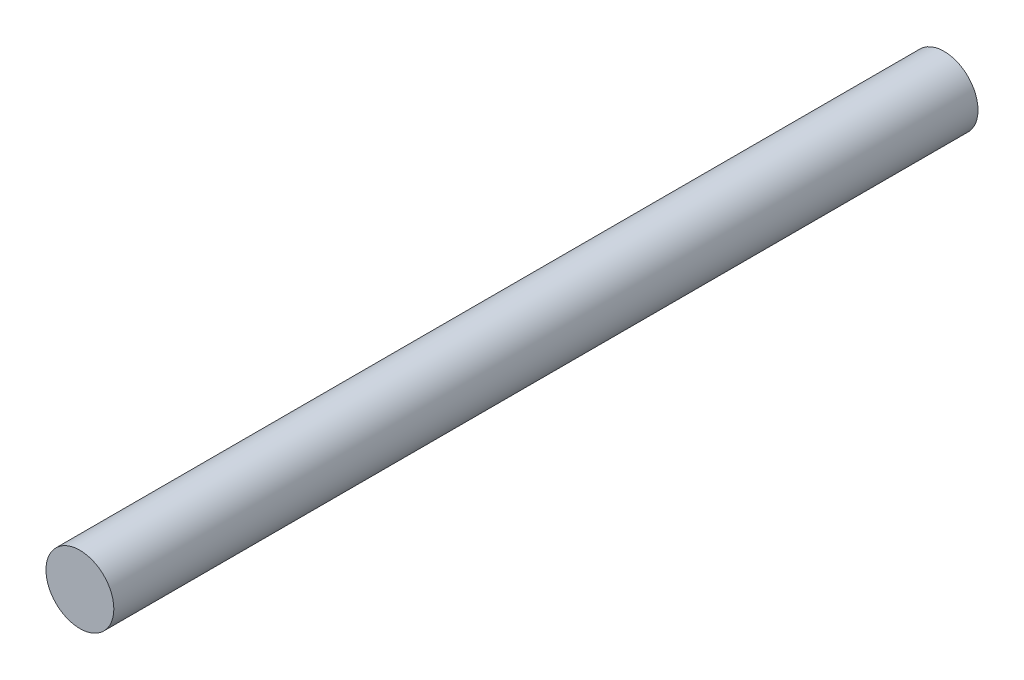
ISO-10303-21;
HEADER;
FILE_DESCRIPTION(('STEP AP214'),'2;1');
FILE_NAME('part.step','',(''),(''),'','','');
FILE_SCHEMA(('AUTOMOTIVE_DESIGN { 1 0 10303 214 1 1 1 1 }'));
ENDSEC;
DATA;
#1=APPLICATION_CONTEXT('core data for automotive mechanical design processes');
#2=APPLICATION_PROTOCOL_DEFINITION('international standard','automotive_design',2000,#1);
#3=PRODUCT_CONTEXT('',#1,'mechanical');
#4=PRODUCT('Part','Part','',(#3));
#5=PRODUCT_RELATED_PRODUCT_CATEGORY('part','',(#4));
#6=PRODUCT_DEFINITION_FORMATION('','',#4);
#7=PRODUCT_DEFINITION_CONTEXT('part definition',#1,'design');
#8=PRODUCT_DEFINITION('design','',#6,#7);
#9=PRODUCT_DEFINITION_SHAPE('','',#8);
#10=(LENGTH_UNIT() NAMED_UNIT(*) SI_UNIT(.MILLI.,.METRE.));
#11=(NAMED_UNIT(*) PLANE_ANGLE_UNIT() SI_UNIT($,.RADIAN.));
#12=(NAMED_UNIT(*) SI_UNIT($,.STERADIAN.) SOLID_ANGLE_UNIT());
#13=UNCERTAINTY_MEASURE_WITH_UNIT(LENGTH_MEASURE(1.E-05),#10,'distance_accuracy_value','');
#14=(GEOMETRIC_REPRESENTATION_CONTEXT(3) GLOBAL_UNCERTAINTY_ASSIGNED_CONTEXT((#13)) GLOBAL_UNIT_ASSIGNED_CONTEXT((#10,
#11,#12)) REPRESENTATION_CONTEXT('',''));
#15=CARTESIAN_POINT('',(0.,0.,0.));
#16=DIRECTION('',(0.,0.,1.));
#17=DIRECTION('',(1.,0.,0.));
#18=AXIS2_PLACEMENT_3D('',#15,#16,#17);
#19=CARTESIAN_POINT('',(-5.31573290540975,-0.624114389703976,70.));
#20=DIRECTION('',(0.,0.,-1.));
#21=DIRECTION('',(-1.,0.,0.));
#22=AXIS2_PLACEMENT_3D('',#19,#20,#21);
#23=CYLINDRICAL_SURFACE('',#22,2.75);
#24=CARTESIAN_POINT('',(-5.31573290540975,-0.624114389703976,70.));
#25=DIRECTION('',(0.,0.,1.));
#26=DIRECTION('',(1.,0.,0.));
#27=AXIS2_PLACEMENT_3D('',#24,#25,#26);
#28=CIRCLE('',#27,2.75);
#29=CARTESIAN_POINT('',(-2.56573290540975,-0.624114389703976,70.));
#30=VERTEX_POINT('',#29);
#31=EDGE_CURVE('E10',#30,#30,#28,.T.);
#32=ORIENTED_EDGE('',*,*,#31,.F.);
#33=EDGE_LOOP('',(#32));
#34=FACE_BOUND('',#33,.T.);
#35=CARTESIAN_POINT('',(-5.31573290540975,-0.624114389703976,0.));
#36=DIRECTION('',(0.,0.,1.));
#37=DIRECTION('',(1.,0.,0.));
#38=AXIS2_PLACEMENT_3D('',#35,#36,#37);
#39=CIRCLE('',#38,2.75);
#40=CARTESIAN_POINT('',(-2.56573290540975,-0.624114389703976,0.));
#41=VERTEX_POINT('',#40);
#42=EDGE_CURVE('E34',#41,#41,#39,.T.);
#43=ORIENTED_EDGE('',*,*,#42,.T.);
#44=EDGE_LOOP('',(#43));
#45=FACE_BOUND('',#44,.T.);
#46=ADVANCED_FACE('F31',(#34,#45),#23,.T.);
#47=CARTESIAN_POINT('',(-5.31573290540975,-0.624114389703976,70.));
#48=DIRECTION('',(0.,0.,1.));
#49=DIRECTION('',(1.,0.,0.));
#50=AXIS2_PLACEMENT_3D('',#47,#48,#49);
#51=PLANE('',#50);
#52=ORIENTED_EDGE('',*,*,#31,.T.);
#53=EDGE_LOOP('',(#52));
#54=FACE_BOUND('',#53,.T.);
#55=ADVANCED_FACE('F46',(#54),#51,.T.);
#56=CARTESIAN_POINT('',(-5.31573290540975,-0.624114389703976,0.));
#57=DIRECTION('',(0.,0.,1.));
#58=DIRECTION('',(1.,0.,0.));
#59=AXIS2_PLACEMENT_3D('',#56,#57,#58);
#60=PLANE('',#59);
#61=ORIENTED_EDGE('',*,*,#42,.F.);
#62=EDGE_LOOP('',(#61));
#63=FACE_BOUND('',#62,.T.);
#64=ADVANCED_FACE('F44',(#63),#60,.F.);
#65=CLOSED_SHELL('',(#46,#55,#64));
#66=MANIFOLD_SOLID_BREP('B2',#65);
#67=ADVANCED_BREP_SHAPE_REPRESENTATION('',(#18,#66),#14);
#68=SHAPE_DEFINITION_REPRESENTATION(#9,#67);
ENDSEC;
END-ISO-10303-21;
